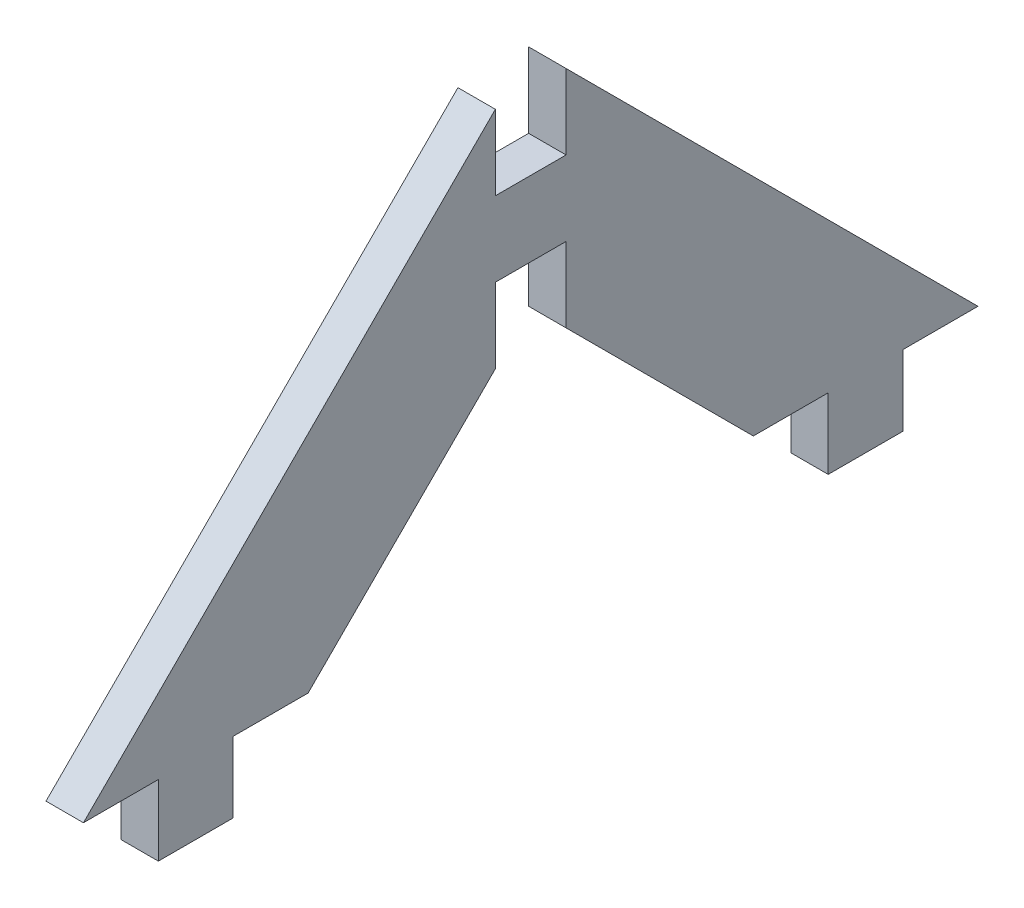
ISO-10303-21;
HEADER;
FILE_DESCRIPTION(('STEP AP214'),'2;1');
FILE_NAME('part.step','',(''),(''),'','','');
FILE_SCHEMA(('AUTOMOTIVE_DESIGN { 1 0 10303 214 1 1 1 1 }'));
ENDSEC;
DATA;
#1=APPLICATION_CONTEXT('core data for automotive mechanical design processes');
#2=APPLICATION_PROTOCOL_DEFINITION('international standard','automotive_design',2000,#1);
#3=PRODUCT_CONTEXT('',#1,'mechanical');
#4=PRODUCT('Part','Part','',(#3));
#5=PRODUCT_RELATED_PRODUCT_CATEGORY('part','',(#4));
#6=PRODUCT_DEFINITION_FORMATION('','',#4);
#7=PRODUCT_DEFINITION_CONTEXT('part definition',#1,'design');
#8=PRODUCT_DEFINITION('design','',#6,#7);
#9=PRODUCT_DEFINITION_SHAPE('','',#8);
#10=(LENGTH_UNIT() NAMED_UNIT(*) SI_UNIT(.MILLI.,.METRE.));
#11=(NAMED_UNIT(*) PLANE_ANGLE_UNIT() SI_UNIT($,.RADIAN.));
#12=(NAMED_UNIT(*) SI_UNIT($,.STERADIAN.) SOLID_ANGLE_UNIT());
#13=UNCERTAINTY_MEASURE_WITH_UNIT(LENGTH_MEASURE(1.E-05),#10,'distance_accuracy_value','');
#14=(GEOMETRIC_REPRESENTATION_CONTEXT(3) GLOBAL_UNCERTAINTY_ASSIGNED_CONTEXT((#13)) GLOBAL_UNIT_ASSIGNED_CONTEXT((#10,
#11,#12)) REPRESENTATION_CONTEXT('',''));
#15=CARTESIAN_POINT('',(0.,0.,0.));
#16=DIRECTION('',(0.,0.,1.));
#17=DIRECTION('',(1.,0.,0.));
#18=AXIS2_PLACEMENT_3D('',#15,#16,#17);
#19=CARTESIAN_POINT('',(3.175,34.925,-34.925));
#20=DIRECTION('',(0.,-0.707106781186547,-0.707106781186548));
#21=DIRECTION('',(0.,0.707106781186548,-0.707106781186547));
#22=AXIS2_PLACEMENT_3D('',#19,#20,#21);
#23=PLANE('',#22);
#24=DIRECTION('',(0.,-0.707106781186548,0.707106781186547));
#25=VECTOR('',#24,1.);
#26=CARTESIAN_POINT('',(0.,34.925,-34.925));
#27=LINE('',#26,#25);
#28=CARTESIAN_POINT('',(0.,34.925,-34.925));
#29=VERTEX_POINT('',#28);
#30=CARTESIAN_POINT('',(0.,0.,0.));
#31=VERTEX_POINT('',#30);
#32=EDGE_CURVE('E200',#29,#31,#27,.T.);
#33=ORIENTED_EDGE('',*,*,#32,.T.);
#34=DIRECTION('',(-1.,0.,0.));
#35=VECTOR('',#34,1.);
#36=CARTESIAN_POINT('',(3.175,0.,0.));
#37=LINE('',#36,#35);
#38=CARTESIAN_POINT('',(3.175,0.,0.));
#39=VERTEX_POINT('',#38);
#40=EDGE_CURVE('E11',#39,#31,#37,.T.);
#41=ORIENTED_EDGE('',*,*,#40,.F.);
#42=DIRECTION('',(0.,-0.707106781186548,0.707106781186547));
#43=VECTOR('',#42,1.);
#44=CARTESIAN_POINT('',(3.175,34.925,-34.925));
#45=LINE('',#44,#43);
#46=CARTESIAN_POINT('',(3.175,34.925,-34.925));
#47=VERTEX_POINT('',#46);
#48=EDGE_CURVE('E238',#47,#39,#45,.T.);
#49=ORIENTED_EDGE('',*,*,#48,.F.);
#50=DIRECTION('',(-1.,0.,0.));
#51=VECTOR('',#50,1.);
#52=CARTESIAN_POINT('',(3.175,34.925,-34.925));
#53=LINE('',#52,#51);
#54=EDGE_CURVE('E196',#47,#29,#53,.T.);
#55=ORIENTED_EDGE('',*,*,#54,.T.);
#56=EDGE_LOOP('',(#33,#41,#49,#55));
#57=FACE_BOUND('',#56,.T.);
#58=ADVANCED_FACE('F32',(#57),#23,.F.);
#59=CARTESIAN_POINT('',(3.175,0.,0.));
#60=DIRECTION('',(0.,1.,0.));
#61=DIRECTION('',(0.,0.,1.));
#62=AXIS2_PLACEMENT_3D('',#59,#60,#61);
#63=PLANE('',#62);
#64=DIRECTION('',(0.,0.,-1.));
#65=VECTOR('',#64,1.);
#66=CARTESIAN_POINT('',(0.,0.,0.));
#67=LINE('',#66,#65);
#68=CARTESIAN_POINT('',(0.,0.,-6.35));
#69=VERTEX_POINT('',#68);
#70=EDGE_CURVE('E203',#31,#69,#67,.T.);
#71=ORIENTED_EDGE('',*,*,#70,.T.);
#72=DIRECTION('',(-1.,0.,0.));
#73=VECTOR('',#72,1.);
#74=CARTESIAN_POINT('',(3.175,0.,-6.35));
#75=LINE('',#74,#73);
#76=CARTESIAN_POINT('',(3.175,0.,-6.35));
#77=VERTEX_POINT('',#76);
#78=EDGE_CURVE('E40',#77,#69,#75,.T.);
#79=ORIENTED_EDGE('',*,*,#78,.F.);
#80=DIRECTION('',(0.,0.,-1.));
#81=VECTOR('',#80,1.);
#82=CARTESIAN_POINT('',(3.175,0.,0.));
#83=LINE('',#82,#81);
#84=EDGE_CURVE('E127',#39,#77,#83,.T.);
#85=ORIENTED_EDGE('',*,*,#84,.F.);
#86=ORIENTED_EDGE('',*,*,#40,.T.);
#87=EDGE_LOOP('',(#71,#79,#85,#86));
#88=FACE_BOUND('',#87,.T.);
#89=ADVANCED_FACE('F356',(#88),#63,.F.);
#90=CARTESIAN_POINT('',(3.175,0.,-6.35));
#91=DIRECTION('',(0.,0.,-1.));
#92=DIRECTION('',(0.,1.,0.));
#93=AXIS2_PLACEMENT_3D('',#90,#91,#92);
#94=PLANE('',#93);
#95=DIRECTION('',(0.,-1.,0.));
#96=VECTOR('',#95,1.);
#97=CARTESIAN_POINT('',(0.,0.,-6.35));
#98=LINE('',#97,#96);
#99=CARTESIAN_POINT('',(0.,-5.9944,-6.35));
#100=VERTEX_POINT('',#99);
#101=EDGE_CURVE('E205',#69,#100,#98,.T.);
#102=ORIENTED_EDGE('',*,*,#101,.T.);
#103=DIRECTION('',(-1.,0.,0.));
#104=VECTOR('',#103,1.);
#105=CARTESIAN_POINT('',(3.175,-5.9944,-6.35));
#106=LINE('',#105,#104);
#107=CARTESIAN_POINT('',(3.175,-5.9944,-6.35));
#108=VERTEX_POINT('',#107);
#109=EDGE_CURVE('E281',#108,#100,#106,.T.);
#110=ORIENTED_EDGE('',*,*,#109,.F.);
#111=DIRECTION('',(0.,-1.,0.));
#112=VECTOR('',#111,1.);
#113=CARTESIAN_POINT('',(3.175,0.,-6.35));
#114=LINE('',#113,#112);
#115=EDGE_CURVE('E289',#77,#108,#114,.T.);
#116=ORIENTED_EDGE('',*,*,#115,.F.);
#117=ORIENTED_EDGE('',*,*,#78,.T.);
#118=EDGE_LOOP('',(#102,#110,#116,#117));
#119=FACE_BOUND('',#118,.T.);
#120=ADVANCED_FACE('F287',(#119),#94,.F.);
#121=CARTESIAN_POINT('',(3.175,-5.9944,-6.35));
#122=DIRECTION('',(0.,1.,0.));
#123=DIRECTION('',(0.,0.,1.));
#124=AXIS2_PLACEMENT_3D('',#121,#122,#123);
#125=PLANE('',#124);
#126=DIRECTION('',(0.,0.,-1.));
#127=VECTOR('',#126,1.);
#128=CARTESIAN_POINT('',(0.,-5.9944,-6.35));
#129=LINE('',#128,#127);
#130=CARTESIAN_POINT('',(0.,-5.9944,-12.7));
#131=VERTEX_POINT('',#130);
#132=EDGE_CURVE('E207',#100,#131,#129,.T.);
#133=ORIENTED_EDGE('',*,*,#132,.T.);
#134=DIRECTION('',(-1.,0.,0.));
#135=VECTOR('',#134,1.);
#136=CARTESIAN_POINT('',(3.175,-5.9944,-12.7));
#137=LINE('',#136,#135);
#138=CARTESIAN_POINT('',(3.175,-5.9944,-12.7));
#139=VERTEX_POINT('',#138);
#140=EDGE_CURVE('E278',#139,#131,#137,.T.);
#141=ORIENTED_EDGE('',*,*,#140,.F.);
#142=DIRECTION('',(0.,0.,-1.));
#143=VECTOR('',#142,1.);
#144=CARTESIAN_POINT('',(3.175,-5.9944,-6.35));
#145=LINE('',#144,#143);
#146=EDGE_CURVE('E307',#108,#139,#145,.T.);
#147=ORIENTED_EDGE('',*,*,#146,.F.);
#148=ORIENTED_EDGE('',*,*,#109,.T.);
#149=EDGE_LOOP('',(#133,#141,#147,#148));
#150=FACE_BOUND('',#149,.T.);
#151=ADVANCED_FACE('F298',(#150),#125,.F.);
#152=CARTESIAN_POINT('',(3.175,-5.9944,-12.7));
#153=DIRECTION('',(0.,0.,1.));
#154=DIRECTION('',(0.,-1.,0.));
#155=AXIS2_PLACEMENT_3D('',#152,#153,#154);
#156=PLANE('',#155);
#157=DIRECTION('',(0.,1.,0.));
#158=VECTOR('',#157,1.);
#159=CARTESIAN_POINT('',(0.,-5.9944,-12.7));
#160=LINE('',#159,#158);
#161=CARTESIAN_POINT('',(0.,0.,-12.7));
#162=VERTEX_POINT('',#161);
#163=EDGE_CURVE('E209',#131,#162,#160,.T.);
#164=ORIENTED_EDGE('',*,*,#163,.T.);
#165=DIRECTION('',(-1.,0.,0.));
#166=VECTOR('',#165,1.);
#167=CARTESIAN_POINT('',(3.175,0.,-12.7));
#168=LINE('',#167,#166);
#169=CARTESIAN_POINT('',(3.175,0.,-12.7));
#170=VERTEX_POINT('',#169);
#171=EDGE_CURVE('E275',#170,#162,#168,.T.);
#172=ORIENTED_EDGE('',*,*,#171,.F.);
#173=DIRECTION('',(0.,1.,0.));
#174=VECTOR('',#173,1.);
#175=CARTESIAN_POINT('',(3.175,-5.9944,-12.7));
#176=LINE('',#175,#174);
#177=EDGE_CURVE('E304',#139,#170,#176,.T.);
#178=ORIENTED_EDGE('',*,*,#177,.F.);
#179=ORIENTED_EDGE('',*,*,#140,.T.);
#180=EDGE_LOOP('',(#164,#172,#178,#179));
#181=FACE_BOUND('',#180,.T.);
#182=ADVANCED_FACE('F302',(#181),#156,.F.);
#183=CARTESIAN_POINT('',(3.175,0.,-12.7));
#184=DIRECTION('',(0.,1.,0.));
#185=DIRECTION('',(0.,0.,1.));
#186=AXIS2_PLACEMENT_3D('',#183,#184,#185);
#187=PLANE('',#186);
#188=DIRECTION('',(0.,0.,-1.));
#189=VECTOR('',#188,1.);
#190=CARTESIAN_POINT('',(0.,0.,-12.7));
#191=LINE('',#190,#189);
#192=CARTESIAN_POINT('',(0.,0.,-19.05));
#193=VERTEX_POINT('',#192);
#194=EDGE_CURVE('E211',#162,#193,#191,.T.);
#195=ORIENTED_EDGE('',*,*,#194,.T.);
#196=DIRECTION('',(-1.,0.,0.));
#197=VECTOR('',#196,1.);
#198=CARTESIAN_POINT('',(3.175,0.,-19.05));
#199=LINE('',#198,#197);
#200=CARTESIAN_POINT('',(3.175,0.,-19.05));
#201=VERTEX_POINT('',#200);
#202=EDGE_CURVE('E272',#201,#193,#199,.T.);
#203=ORIENTED_EDGE('',*,*,#202,.F.);
#204=DIRECTION('',(0.,0.,-1.));
#205=VECTOR('',#204,1.);
#206=CARTESIAN_POINT('',(3.175,0.,-12.7));
#207=LINE('',#206,#205);
#208=EDGE_CURVE('E306',#170,#201,#207,.T.);
#209=ORIENTED_EDGE('',*,*,#208,.F.);
#210=ORIENTED_EDGE('',*,*,#171,.T.);
#211=EDGE_LOOP('',(#195,#203,#209,#210));
#212=FACE_BOUND('',#211,.T.);
#213=ADVANCED_FACE('F369',(#212),#187,.F.);
#214=CARTESIAN_POINT('',(3.175,0.,-19.05));
#215=DIRECTION('',(0.,0.707106781186547,0.707106781186548));
#216=DIRECTION('',(0.,-0.707106781186548,0.707106781186547));
#217=AXIS2_PLACEMENT_3D('',#214,#215,#216);
#218=PLANE('',#217);
#219=DIRECTION('',(0.,0.707106781186548,-0.707106781186547));
#220=VECTOR('',#219,1.);
#221=CARTESIAN_POINT('',(0.,0.,-19.05));
#222=LINE('',#221,#220);
#223=CARTESIAN_POINT('',(0.,15.875,-34.925));
#224=VERTEX_POINT('',#223);
#225=EDGE_CURVE('E213',#193,#224,#222,.T.);
#226=ORIENTED_EDGE('',*,*,#225,.T.);
#227=DIRECTION('',(-1.,0.,0.));
#228=VECTOR('',#227,1.);
#229=CARTESIAN_POINT('',(3.175,15.875,-34.925));
#230=LINE('',#229,#228);
#231=CARTESIAN_POINT('',(3.175,15.875,-34.925));
#232=VERTEX_POINT('',#231);
#233=EDGE_CURVE('E269',#232,#224,#230,.T.);
#234=ORIENTED_EDGE('',*,*,#233,.F.);
#235=DIRECTION('',(0.,0.707106781186548,-0.707106781186547));
#236=VECTOR('',#235,1.);
#237=CARTESIAN_POINT('',(3.175,0.,-19.05));
#238=LINE('',#237,#236);
#239=EDGE_CURVE('E309',#201,#232,#238,.T.);
#240=ORIENTED_EDGE('',*,*,#239,.F.);
#241=ORIENTED_EDGE('',*,*,#202,.T.);
#242=EDGE_LOOP('',(#226,#234,#240,#241));
#243=FACE_BOUND('',#242,.T.);
#244=ADVANCED_FACE('F372',(#243),#218,.F.);
#245=CARTESIAN_POINT('',(3.175,15.875,-34.925));
#246=DIRECTION('',(0.,0.,1.));
#247=DIRECTION('',(1.,0.,0.));
#248=AXIS2_PLACEMENT_3D('',#245,#246,#247);
#249=PLANE('',#248);
#250=DIRECTION('',(0.,1.,0.));
#251=VECTOR('',#250,1.);
#252=CARTESIAN_POINT('',(0.,15.875,-34.925));
#253=LINE('',#252,#251);
#254=CARTESIAN_POINT('',(0.,22.225,-34.925));
#255=VERTEX_POINT('',#254);
#256=EDGE_CURVE('E215',#224,#255,#253,.T.);
#257=ORIENTED_EDGE('',*,*,#256,.T.);
#258=DIRECTION('',(-1.,0.,0.));
#259=VECTOR('',#258,1.);
#260=CARTESIAN_POINT('',(3.175,22.225,-34.925));
#261=LINE('',#260,#259);
#262=CARTESIAN_POINT('',(3.175,22.225,-34.925));
#263=VERTEX_POINT('',#262);
#264=EDGE_CURVE('E266',#263,#255,#261,.T.);
#265=ORIENTED_EDGE('',*,*,#264,.F.);
#266=DIRECTION('',(0.,1.,0.));
#267=VECTOR('',#266,1.);
#268=CARTESIAN_POINT('',(3.175,15.875,-34.925));
#269=LINE('',#268,#267);
#270=EDGE_CURVE('E315',#232,#263,#269,.T.);
#271=ORIENTED_EDGE('',*,*,#270,.F.);
#272=ORIENTED_EDGE('',*,*,#233,.T.);
#273=EDGE_LOOP('',(#257,#265,#271,#272));
#274=FACE_BOUND('',#273,.T.);
#275=ADVANCED_FACE('F376',(#274),#249,.F.);
#276=CARTESIAN_POINT('',(3.175,22.225,-34.925));
#277=DIRECTION('',(0.,1.,0.));
#278=DIRECTION('',(0.,0.,1.));
#279=AXIS2_PLACEMENT_3D('',#276,#277,#278);
#280=PLANE('',#279);
#281=DIRECTION('',(0.,0.,-1.));
#282=VECTOR('',#281,1.);
#283=CARTESIAN_POINT('',(0.,22.225,-34.925));
#284=LINE('',#283,#282);
#285=CARTESIAN_POINT('',(0.,22.225,-40.9194));
#286=VERTEX_POINT('',#285);
#287=EDGE_CURVE('E217',#255,#286,#284,.T.);
#288=ORIENTED_EDGE('',*,*,#287,.T.);
#289=DIRECTION('',(-1.,0.,0.));
#290=VECTOR('',#289,1.);
#291=CARTESIAN_POINT('',(3.175,22.225,-40.9194));
#292=LINE('',#291,#290);
#293=CARTESIAN_POINT('',(3.175,22.225,-40.9194));
#294=VERTEX_POINT('',#293);
#295=EDGE_CURVE('E263',#294,#286,#292,.T.);
#296=ORIENTED_EDGE('',*,*,#295,.F.);
#297=DIRECTION('',(0.,0.,-1.));
#298=VECTOR('',#297,1.);
#299=CARTESIAN_POINT('',(3.175,22.225,-34.925));
#300=LINE('',#299,#298);
#301=EDGE_CURVE('E317',#263,#294,#300,.T.);
#302=ORIENTED_EDGE('',*,*,#301,.F.);
#303=ORIENTED_EDGE('',*,*,#264,.T.);
#304=EDGE_LOOP('',(#288,#296,#302,#303));
#305=FACE_BOUND('',#304,.T.);
#306=ADVANCED_FACE('F380',(#305),#280,.F.);
#307=CARTESIAN_POINT('',(3.175,22.225,-40.9194));
#308=DIRECTION('',(0.,0.,-1.));
#309=DIRECTION('',(-1.,0.,0.));
#310=AXIS2_PLACEMENT_3D('',#307,#308,#309);
#311=PLANE('',#310);
#312=DIRECTION('',(0.,-1.,0.));
#313=VECTOR('',#312,1.);
#314=CARTESIAN_POINT('',(0.,22.225,-40.9194));
#315=LINE('',#314,#313);
#316=CARTESIAN_POINT('',(0.,15.875,-40.9194));
#317=VERTEX_POINT('',#316);
#318=EDGE_CURVE('E219',#286,#317,#315,.T.);
#319=ORIENTED_EDGE('',*,*,#318,.T.);
#320=DIRECTION('',(-1.,0.,0.));
#321=VECTOR('',#320,1.);
#322=CARTESIAN_POINT('',(3.175,15.875,-40.9194));
#323=LINE('',#322,#321);
#324=CARTESIAN_POINT('',(3.175,15.875,-40.9194));
#325=VERTEX_POINT('',#324);
#326=EDGE_CURVE('E260',#325,#317,#323,.T.);
#327=ORIENTED_EDGE('',*,*,#326,.F.);
#328=DIRECTION('',(0.,-1.,0.));
#329=VECTOR('',#328,1.);
#330=CARTESIAN_POINT('',(3.175,22.225,-40.9194));
#331=LINE('',#330,#329);
#332=EDGE_CURVE('E319',#294,#325,#331,.T.);
#333=ORIENTED_EDGE('',*,*,#332,.F.);
#334=ORIENTED_EDGE('',*,*,#295,.T.);
#335=EDGE_LOOP('',(#319,#327,#333,#334));
#336=FACE_BOUND('',#335,.T.);
#337=ADVANCED_FACE('F384',(#336),#311,.F.);
#338=CARTESIAN_POINT('',(3.175,15.875,-40.9194));
#339=DIRECTION('',(0.,0.707106781186548,-0.707106781186547));
#340=DIRECTION('',(0.,0.707106781186547,0.707106781186548));
#341=AXIS2_PLACEMENT_3D('',#338,#339,#340);
#342=PLANE('',#341);
#343=DIRECTION('',(0.,-0.707106781186547,-0.707106781186548));
#344=VECTOR('',#343,1.);
#345=CARTESIAN_POINT('',(0.,15.875,-40.9194));
#346=LINE('',#345,#344);
#347=CARTESIAN_POINT('',(0.,0.,-56.7943999999999));
#348=VERTEX_POINT('',#347);
#349=EDGE_CURVE('E221',#317,#348,#346,.T.);
#350=ORIENTED_EDGE('',*,*,#349,.T.);
#351=DIRECTION('',(-1.,0.,0.));
#352=VECTOR('',#351,1.);
#353=CARTESIAN_POINT('',(3.175,0.,-56.7943999999999));
#354=LINE('',#353,#352);
#355=CARTESIAN_POINT('',(3.175,0.,-56.7943999999999));
#356=VERTEX_POINT('',#355);
#357=EDGE_CURVE('E257',#356,#348,#354,.T.);
#358=ORIENTED_EDGE('',*,*,#357,.F.);
#359=DIRECTION('',(0.,-0.707106781186547,-0.707106781186548));
#360=VECTOR('',#359,1.);
#361=CARTESIAN_POINT('',(3.175,15.875,-40.9194));
#362=LINE('',#361,#360);
#363=EDGE_CURVE('E321',#325,#356,#362,.T.);
#364=ORIENTED_EDGE('',*,*,#363,.F.);
#365=ORIENTED_EDGE('',*,*,#326,.T.);
#366=EDGE_LOOP('',(#350,#358,#364,#365));
#367=FACE_BOUND('',#366,.T.);
#368=ADVANCED_FACE('F388',(#367),#342,.F.);
#369=CARTESIAN_POINT('',(3.175,0.,-56.7943999999999));
#370=DIRECTION('',(0.,1.,0.));
#371=DIRECTION('',(0.,0.,1.));
#372=AXIS2_PLACEMENT_3D('',#369,#370,#371);
#373=PLANE('',#372);
#374=DIRECTION('',(0.,0.,-1.));
#375=VECTOR('',#374,1.);
#376=CARTESIAN_POINT('',(0.,0.,-56.7943999999999));
#377=LINE('',#376,#375);
#378=CARTESIAN_POINT('',(0.,0.,-63.1443999999999));
#379=VERTEX_POINT('',#378);
#380=EDGE_CURVE('E223',#348,#379,#377,.T.);
#381=ORIENTED_EDGE('',*,*,#380,.T.);
#382=DIRECTION('',(-1.,0.,0.));
#383=VECTOR('',#382,1.);
#384=CARTESIAN_POINT('',(3.175,0.,-63.1443999999999));
#385=LINE('',#384,#383);
#386=CARTESIAN_POINT('',(3.175,0.,-63.1443999999999));
#387=VERTEX_POINT('',#386);
#388=EDGE_CURVE('E254',#387,#379,#385,.T.);
#389=ORIENTED_EDGE('',*,*,#388,.F.);
#390=DIRECTION('',(0.,0.,-1.));
#391=VECTOR('',#390,1.);
#392=CARTESIAN_POINT('',(3.175,0.,-56.7943999999999));
#393=LINE('',#392,#391);
#394=EDGE_CURVE('E323',#356,#387,#393,.T.);
#395=ORIENTED_EDGE('',*,*,#394,.F.);
#396=ORIENTED_EDGE('',*,*,#357,.T.);
#397=EDGE_LOOP('',(#381,#389,#395,#396));
#398=FACE_BOUND('',#397,.T.);
#399=ADVANCED_FACE('F392',(#398),#373,.F.);
#400=CARTESIAN_POINT('',(3.175,0.,-63.1443999999999));
#401=DIRECTION('',(0.,0.,-1.));
#402=DIRECTION('',(-1.,0.,0.));
#403=AXIS2_PLACEMENT_3D('',#400,#401,#402);
#404=PLANE('',#403);
#405=DIRECTION('',(0.,-1.,0.));
#406=VECTOR('',#405,1.);
#407=CARTESIAN_POINT('',(0.,0.,-63.1443999999999));
#408=LINE('',#407,#406);
#409=CARTESIAN_POINT('',(0.,-5.9944,-63.1443999999999));
#410=VERTEX_POINT('',#409);
#411=EDGE_CURVE('E225',#379,#410,#408,.T.);
#412=ORIENTED_EDGE('',*,*,#411,.T.);
#413=DIRECTION('',(-1.,0.,0.));
#414=VECTOR('',#413,1.);
#415=CARTESIAN_POINT('',(3.175,-5.9944,-63.1443999999999));
#416=LINE('',#415,#414);
#417=CARTESIAN_POINT('',(3.175,-5.9944,-63.1443999999999));
#418=VERTEX_POINT('',#417);
#419=EDGE_CURVE('E251',#418,#410,#416,.T.);
#420=ORIENTED_EDGE('',*,*,#419,.F.);
#421=DIRECTION('',(0.,-1.,0.));
#422=VECTOR('',#421,1.);
#423=CARTESIAN_POINT('',(3.175,0.,-63.1443999999999));
#424=LINE('',#423,#422);
#425=EDGE_CURVE('E325',#387,#418,#424,.T.);
#426=ORIENTED_EDGE('',*,*,#425,.F.);
#427=ORIENTED_EDGE('',*,*,#388,.T.);
#428=EDGE_LOOP('',(#412,#420,#426,#427));
#429=FACE_BOUND('',#428,.T.);
#430=ADVANCED_FACE('F396',(#429),#404,.F.);
#431=CARTESIAN_POINT('',(3.175,-5.9944,-63.1443999999999));
#432=DIRECTION('',(0.,1.,0.));
#433=DIRECTION('',(0.,0.,1.));
#434=AXIS2_PLACEMENT_3D('',#431,#432,#433);
#435=PLANE('',#434);
#436=DIRECTION('',(0.,0.,-1.));
#437=VECTOR('',#436,1.);
#438=CARTESIAN_POINT('',(0.,-5.9944,-63.1443999999999));
#439=LINE('',#438,#437);
#440=CARTESIAN_POINT('',(0.,-5.9944,-69.4943999999999));
#441=VERTEX_POINT('',#440);
#442=EDGE_CURVE('E227',#410,#441,#439,.T.);
#443=ORIENTED_EDGE('',*,*,#442,.T.);
#444=DIRECTION('',(-1.,0.,0.));
#445=VECTOR('',#444,1.);
#446=CARTESIAN_POINT('',(3.175,-5.9944,-69.4943999999999));
#447=LINE('',#446,#445);
#448=CARTESIAN_POINT('',(3.175,-5.9944,-69.4943999999999));
#449=VERTEX_POINT('',#448);
#450=EDGE_CURVE('E248',#449,#441,#447,.T.);
#451=ORIENTED_EDGE('',*,*,#450,.F.);
#452=DIRECTION('',(0.,0.,-1.));
#453=VECTOR('',#452,1.);
#454=CARTESIAN_POINT('',(3.175,-5.9944,-63.1443999999999));
#455=LINE('',#454,#453);
#456=EDGE_CURVE('E327',#418,#449,#455,.T.);
#457=ORIENTED_EDGE('',*,*,#456,.F.);
#458=ORIENTED_EDGE('',*,*,#419,.T.);
#459=EDGE_LOOP('',(#443,#451,#457,#458));
#460=FACE_BOUND('',#459,.T.);
#461=ADVANCED_FACE('F400',(#460),#435,.F.);
#462=CARTESIAN_POINT('',(3.175,-5.9944,-69.4943999999999));
#463=DIRECTION('',(0.,0.,1.));
#464=DIRECTION('',(1.,0.,0.));
#465=AXIS2_PLACEMENT_3D('',#462,#463,#464);
#466=PLANE('',#465);
#467=DIRECTION('',(0.,1.,0.));
#468=VECTOR('',#467,1.);
#469=CARTESIAN_POINT('',(0.,-5.9944,-69.4943999999999));
#470=LINE('',#469,#468);
#471=CARTESIAN_POINT('',(0.,0.,-69.4943999999999));
#472=VERTEX_POINT('',#471);
#473=EDGE_CURVE('E229',#441,#472,#470,.T.);
#474=ORIENTED_EDGE('',*,*,#473,.T.);
#475=DIRECTION('',(-1.,0.,0.));
#476=VECTOR('',#475,1.);
#477=CARTESIAN_POINT('',(3.175,0.,-69.4943999999999));
#478=LINE('',#477,#476);
#479=CARTESIAN_POINT('',(3.175,0.,-69.4943999999999));
#480=VERTEX_POINT('',#479);
#481=EDGE_CURVE('E245',#480,#472,#478,.T.);
#482=ORIENTED_EDGE('',*,*,#481,.F.);
#483=DIRECTION('',(0.,1.,0.));
#484=VECTOR('',#483,1.);
#485=CARTESIAN_POINT('',(3.175,-5.9944,-69.4943999999999));
#486=LINE('',#485,#484);
#487=EDGE_CURVE('E329',#449,#480,#486,.T.);
#488=ORIENTED_EDGE('',*,*,#487,.F.);
#489=ORIENTED_EDGE('',*,*,#450,.T.);
#490=EDGE_LOOP('',(#474,#482,#488,#489));
#491=FACE_BOUND('',#490,.T.);
#492=ADVANCED_FACE('F404',(#491),#466,.F.);
#493=CARTESIAN_POINT('',(3.175,0.,-69.4943999999999));
#494=DIRECTION('',(0.,1.,0.));
#495=DIRECTION('',(0.,0.,1.));
#496=AXIS2_PLACEMENT_3D('',#493,#494,#495);
#497=PLANE('',#496);
#498=DIRECTION('',(0.,0.,-1.));
#499=VECTOR('',#498,1.);
#500=CARTESIAN_POINT('',(0.,0.,-69.4943999999999));
#501=LINE('',#500,#499);
#502=CARTESIAN_POINT('',(0.,0.,-75.8444));
#503=VERTEX_POINT('',#502);
#504=EDGE_CURVE('E231',#472,#503,#501,.T.);
#505=ORIENTED_EDGE('',*,*,#504,.T.);
#506=DIRECTION('',(-1.,0.,0.));
#507=VECTOR('',#506,1.);
#508=CARTESIAN_POINT('',(3.175,0.,-75.8444));
#509=LINE('',#508,#507);
#510=CARTESIAN_POINT('',(3.175,0.,-75.8444));
#511=VERTEX_POINT('',#510);
#512=EDGE_CURVE('E242',#511,#503,#509,.T.);
#513=ORIENTED_EDGE('',*,*,#512,.F.);
#514=DIRECTION('',(0.,0.,-1.));
#515=VECTOR('',#514,1.);
#516=CARTESIAN_POINT('',(3.175,0.,-69.4943999999999));
#517=LINE('',#516,#515);
#518=EDGE_CURVE('E331',#480,#511,#517,.T.);
#519=ORIENTED_EDGE('',*,*,#518,.F.);
#520=ORIENTED_EDGE('',*,*,#481,.T.);
#521=EDGE_LOOP('',(#505,#513,#519,#520));
#522=FACE_BOUND('',#521,.T.);
#523=ADVANCED_FACE('F337',(#522),#497,.F.);
#524=CARTESIAN_POINT('',(3.175,0.,-75.8444));
#525=DIRECTION('',(0.,-0.707106781186548,0.707106781186547));
#526=DIRECTION('',(0.,-0.707106781186547,-0.707106781186548));
#527=AXIS2_PLACEMENT_3D('',#524,#525,#526);
#528=PLANE('',#527);
#529=DIRECTION('',(0.,0.707106781186547,0.707106781186548));
#530=VECTOR('',#529,1.);
#531=CARTESIAN_POINT('',(0.,0.,-75.8444));
#532=LINE('',#531,#530);
#533=CARTESIAN_POINT('',(0.,34.925,-40.9194));
#534=VERTEX_POINT('',#533);
#535=EDGE_CURVE('E233',#503,#534,#532,.T.);
#536=ORIENTED_EDGE('',*,*,#535,.T.);
#537=DIRECTION('',(-1.,0.,0.));
#538=VECTOR('',#537,1.);
#539=CARTESIAN_POINT('',(3.175,34.925,-40.9194));
#540=LINE('',#539,#538);
#541=CARTESIAN_POINT('',(3.175,34.925,-40.9194));
#542=VERTEX_POINT('',#541);
#543=EDGE_CURVE('E191',#542,#534,#540,.T.);
#544=ORIENTED_EDGE('',*,*,#543,.F.);
#545=DIRECTION('',(0.,0.707106781186547,0.707106781186548));
#546=VECTOR('',#545,1.);
#547=CARTESIAN_POINT('',(3.175,0.,-75.8444));
#548=LINE('',#547,#546);
#549=EDGE_CURVE('E182',#511,#542,#548,.T.);
#550=ORIENTED_EDGE('',*,*,#549,.F.);
#551=ORIENTED_EDGE('',*,*,#512,.T.);
#552=EDGE_LOOP('',(#536,#544,#550,#551));
#553=FACE_BOUND('',#552,.T.);
#554=ADVANCED_FACE('F341',(#553),#528,.F.);
#555=CARTESIAN_POINT('',(3.175,34.925,-40.9194));
#556=DIRECTION('',(0.,0.,-1.));
#557=DIRECTION('',(0.,1.,0.));
#558=AXIS2_PLACEMENT_3D('',#555,#556,#557);
#559=PLANE('',#558);
#560=DIRECTION('',(0.,-1.,0.));
#561=VECTOR('',#560,1.);
#562=CARTESIAN_POINT('',(0.,34.925,-40.9194));
#563=LINE('',#562,#561);
#564=CARTESIAN_POINT('',(0.,28.575,-40.9193999999999));
#565=VERTEX_POINT('',#564);
#566=EDGE_CURVE('E190',#534,#565,#563,.T.);
#567=ORIENTED_EDGE('',*,*,#566,.T.);
#568=DIRECTION('',(-1.,0.,0.));
#569=VECTOR('',#568,1.);
#570=CARTESIAN_POINT('',(3.175,28.575,-40.9193999999999));
#571=LINE('',#570,#569);
#572=CARTESIAN_POINT('',(3.175,28.575,-40.9193999999999));
#573=VERTEX_POINT('',#572);
#574=EDGE_CURVE('E187',#573,#565,#571,.T.);
#575=ORIENTED_EDGE('',*,*,#574,.F.);
#576=DIRECTION('',(0.,-1.,0.));
#577=VECTOR('',#576,1.);
#578=CARTESIAN_POINT('',(3.175,34.925,-40.9194));
#579=LINE('',#578,#577);
#580=EDGE_CURVE('E176',#542,#573,#579,.T.);
#581=ORIENTED_EDGE('',*,*,#580,.F.);
#582=ORIENTED_EDGE('',*,*,#543,.T.);
#583=EDGE_LOOP('',(#567,#575,#581,#582));
#584=FACE_BOUND('',#583,.T.);
#585=ADVANCED_FACE('F188',(#584),#559,.F.);
#586=CARTESIAN_POINT('',(3.175,28.575,-40.9193999999999));
#587=DIRECTION('',(0.,-1.,0.));
#588=DIRECTION('',(0.,0.,-1.));
#589=AXIS2_PLACEMENT_3D('',#586,#587,#588);
#590=PLANE('',#589);
#591=DIRECTION('',(0.,0.,1.));
#592=VECTOR('',#591,1.);
#593=CARTESIAN_POINT('',(0.,28.575,-40.9193999999999));
#594=LINE('',#593,#592);
#595=CARTESIAN_POINT('',(0.,28.575,-34.925));
#596=VERTEX_POINT('',#595);
#597=EDGE_CURVE('E113',#565,#596,#594,.T.);
#598=ORIENTED_EDGE('',*,*,#597,.T.);
#599=DIRECTION('',(-1.,0.,0.));
#600=VECTOR('',#599,1.);
#601=CARTESIAN_POINT('',(3.175,28.575,-34.925));
#602=LINE('',#601,#600);
#603=CARTESIAN_POINT('',(3.175,28.575,-34.925));
#604=VERTEX_POINT('',#603);
#605=EDGE_CURVE('E192',#604,#596,#602,.T.);
#606=ORIENTED_EDGE('',*,*,#605,.F.);
#607=DIRECTION('',(0.,0.,1.));
#608=VECTOR('',#607,1.);
#609=CARTESIAN_POINT('',(3.175,28.575,-40.9193999999999));
#610=LINE('',#609,#608);
#611=EDGE_CURVE('E180',#573,#604,#610,.T.);
#612=ORIENTED_EDGE('',*,*,#611,.F.);
#613=ORIENTED_EDGE('',*,*,#574,.T.);
#614=EDGE_LOOP('',(#598,#606,#612,#613));
#615=FACE_BOUND('',#614,.T.);
#616=ADVANCED_FACE('F194',(#615),#590,.F.);
#617=CARTESIAN_POINT('',(3.175,28.575,-34.925));
#618=DIRECTION('',(0.,0.,1.));
#619=DIRECTION('',(1.,0.,0.));
#620=AXIS2_PLACEMENT_3D('',#617,#618,#619);
#621=PLANE('',#620);
#622=DIRECTION('',(0.,1.,0.));
#623=VECTOR('',#622,1.);
#624=CARTESIAN_POINT('',(0.,28.575,-34.925));
#625=LINE('',#624,#623);
#626=EDGE_CURVE('E119',#596,#29,#625,.T.);
#627=ORIENTED_EDGE('',*,*,#626,.T.);
#628=ORIENTED_EDGE('',*,*,#54,.F.);
#629=DIRECTION('',(0.,1.,0.));
#630=VECTOR('',#629,1.);
#631=CARTESIAN_POINT('',(3.175,28.575,-34.925));
#632=LINE('',#631,#630);
#633=EDGE_CURVE('E48',#604,#47,#632,.T.);
#634=ORIENTED_EDGE('',*,*,#633,.F.);
#635=ORIENTED_EDGE('',*,*,#605,.T.);
#636=EDGE_LOOP('',(#627,#628,#634,#635));
#637=FACE_BOUND('',#636,.T.);
#638=ADVANCED_FACE('F345',(#637),#621,.F.);
#639=CARTESIAN_POINT('',(3.175,0.,0.));
#640=DIRECTION('',(1.,0.,0.));
#641=DIRECTION('',(0.,0.,-1.));
#642=AXIS2_PLACEMENT_3D('',#639,#640,#641);
#643=PLANE('',#642);
#644=ORIENTED_EDGE('',*,*,#48,.T.);
#645=ORIENTED_EDGE('',*,*,#84,.T.);
#646=ORIENTED_EDGE('',*,*,#115,.T.);
#647=ORIENTED_EDGE('',*,*,#146,.T.);
#648=ORIENTED_EDGE('',*,*,#177,.T.);
#649=ORIENTED_EDGE('',*,*,#208,.T.);
#650=ORIENTED_EDGE('',*,*,#239,.T.);
#651=ORIENTED_EDGE('',*,*,#270,.T.);
#652=ORIENTED_EDGE('',*,*,#301,.T.);
#653=ORIENTED_EDGE('',*,*,#332,.T.);
#654=ORIENTED_EDGE('',*,*,#363,.T.);
#655=ORIENTED_EDGE('',*,*,#394,.T.);
#656=ORIENTED_EDGE('',*,*,#425,.T.);
#657=ORIENTED_EDGE('',*,*,#456,.T.);
#658=ORIENTED_EDGE('',*,*,#487,.T.);
#659=ORIENTED_EDGE('',*,*,#518,.T.);
#660=ORIENTED_EDGE('',*,*,#549,.T.);
#661=ORIENTED_EDGE('',*,*,#580,.T.);
#662=ORIENTED_EDGE('',*,*,#611,.T.);
#663=ORIENTED_EDGE('',*,*,#633,.T.);
#664=EDGE_LOOP('',(#644,#645,#646,#647,#648,#649,#650,#651,#652,#653,#654,#655,#656,#657,#658,
#659,#660,#661,#662,#663));
#665=FACE_BOUND('',#664,.T.);
#666=ADVANCED_FACE('F178',(#665),#643,.T.);
#667=CARTESIAN_POINT('',(0.,0.,0.));
#668=DIRECTION('',(1.,0.,0.));
#669=DIRECTION('',(0.,0.,-1.));
#670=AXIS2_PLACEMENT_3D('',#667,#668,#669);
#671=PLANE('',#670);
#672=ORIENTED_EDGE('',*,*,#32,.F.);
#673=ORIENTED_EDGE('',*,*,#626,.F.);
#674=ORIENTED_EDGE('',*,*,#597,.F.);
#675=ORIENTED_EDGE('',*,*,#566,.F.);
#676=ORIENTED_EDGE('',*,*,#535,.F.);
#677=ORIENTED_EDGE('',*,*,#504,.F.);
#678=ORIENTED_EDGE('',*,*,#473,.F.);
#679=ORIENTED_EDGE('',*,*,#442,.F.);
#680=ORIENTED_EDGE('',*,*,#411,.F.);
#681=ORIENTED_EDGE('',*,*,#380,.F.);
#682=ORIENTED_EDGE('',*,*,#349,.F.);
#683=ORIENTED_EDGE('',*,*,#318,.F.);
#684=ORIENTED_EDGE('',*,*,#287,.F.);
#685=ORIENTED_EDGE('',*,*,#256,.F.);
#686=ORIENTED_EDGE('',*,*,#225,.F.);
#687=ORIENTED_EDGE('',*,*,#194,.F.);
#688=ORIENTED_EDGE('',*,*,#163,.F.);
#689=ORIENTED_EDGE('',*,*,#132,.F.);
#690=ORIENTED_EDGE('',*,*,#101,.F.);
#691=ORIENTED_EDGE('',*,*,#70,.F.);
#692=EDGE_LOOP('',(#672,#673,#674,#675,#676,#677,#678,#679,#680,#681,#682,#683,#684,#685,#686,
#687,#688,#689,#690,#691));
#693=FACE_BOUND('',#692,.T.);
#694=ADVANCED_FACE('F293',(#693),#671,.F.);
#695=CLOSED_SHELL('',(#58,#89,#120,#151,#182,#213,#244,#275,#306,#337,#368,#399,#430,#461,#492,
#523,#554,#585,#616,#638,#666,#694));
#696=MANIFOLD_SOLID_BREP('B2',#695);
#697=ADVANCED_BREP_SHAPE_REPRESENTATION('',(#18,#696),#14);
#698=SHAPE_DEFINITION_REPRESENTATION(#9,#697);
ENDSEC;
END-ISO-10303-21;
